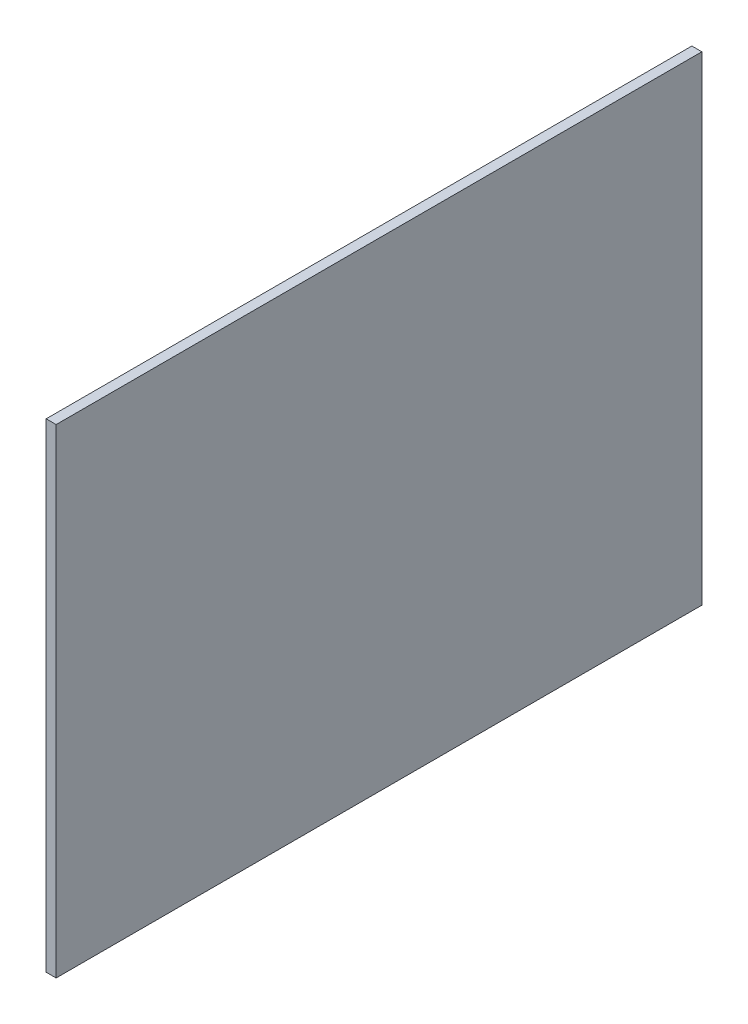
ISO-10303-21;
HEADER;
FILE_DESCRIPTION(('STEP AP214'),'2;1');
FILE_NAME('part.step','',(''),(''),'','','');
FILE_SCHEMA(('AUTOMOTIVE_DESIGN { 1 0 10303 214 1 1 1 1 }'));
ENDSEC;
DATA;
#1=APPLICATION_CONTEXT('core data for automotive mechanical design processes');
#2=APPLICATION_PROTOCOL_DEFINITION('international standard','automotive_design',2000,#1);
#3=PRODUCT_CONTEXT('',#1,'mechanical');
#4=PRODUCT('Part','Part','',(#3));
#5=PRODUCT_RELATED_PRODUCT_CATEGORY('part','',(#4));
#6=PRODUCT_DEFINITION_FORMATION('','',#4);
#7=PRODUCT_DEFINITION_CONTEXT('part definition',#1,'design');
#8=PRODUCT_DEFINITION('design','',#6,#7);
#9=PRODUCT_DEFINITION_SHAPE('','',#8);
#10=(LENGTH_UNIT() NAMED_UNIT(*) SI_UNIT(.MILLI.,.METRE.));
#11=(NAMED_UNIT(*) PLANE_ANGLE_UNIT() SI_UNIT($,.RADIAN.));
#12=(NAMED_UNIT(*) SI_UNIT($,.STERADIAN.) SOLID_ANGLE_UNIT());
#13=UNCERTAINTY_MEASURE_WITH_UNIT(LENGTH_MEASURE(1.E-05),#10,'distance_accuracy_value','');
#14=(GEOMETRIC_REPRESENTATION_CONTEXT(3) GLOBAL_UNCERTAINTY_ASSIGNED_CONTEXT((#13)) GLOBAL_UNIT_ASSIGNED_CONTEXT((#10,
#11,#12)) REPRESENTATION_CONTEXT('',''));
#15=CARTESIAN_POINT('',(0.,0.,0.));
#16=DIRECTION('',(0.,0.,1.));
#17=DIRECTION('',(1.,0.,0.));
#18=AXIS2_PLACEMENT_3D('',#15,#16,#17);
#19=CARTESIAN_POINT('',(3.,72.,97.));
#20=DIRECTION('',(0.,0.,-1.));
#21=DIRECTION('',(0.,1.,0.));
#22=AXIS2_PLACEMENT_3D('',#19,#20,#21);
#23=PLANE('',#22);
#24=DIRECTION('',(0.,-1.,0.));
#25=VECTOR('',#24,1.);
#26=CARTESIAN_POINT('',(0.,72.,97.));
#27=LINE('',#26,#25);
#28=CARTESIAN_POINT('',(0.,72.,97.));
#29=VERTEX_POINT('',#28);
#30=CARTESIAN_POINT('',(0.,-72.,97.));
#31=VERTEX_POINT('',#30);
#32=EDGE_CURVE('E98',#29,#31,#27,.T.);
#33=ORIENTED_EDGE('',*,*,#32,.T.);
#34=DIRECTION('',(-1.,0.,0.));
#35=VECTOR('',#34,1.);
#36=CARTESIAN_POINT('',(3.,-72.,97.));
#37=LINE('',#36,#35);
#38=CARTESIAN_POINT('',(3.,-72.,97.));
#39=VERTEX_POINT('',#38);
#40=EDGE_CURVE('E11',#39,#31,#37,.T.);
#41=ORIENTED_EDGE('',*,*,#40,.F.);
#42=DIRECTION('',(0.,-1.,0.));
#43=VECTOR('',#42,1.);
#44=CARTESIAN_POINT('',(3.,72.,97.));
#45=LINE('',#44,#43);
#46=CARTESIAN_POINT('',(3.,72.,97.));
#47=VERTEX_POINT('',#46);
#48=EDGE_CURVE('E86',#47,#39,#45,.T.);
#49=ORIENTED_EDGE('',*,*,#48,.F.);
#50=DIRECTION('',(-1.,0.,0.));
#51=VECTOR('',#50,1.);
#52=CARTESIAN_POINT('',(3.,72.,97.));
#53=LINE('',#52,#51);
#54=EDGE_CURVE('E94',#47,#29,#53,.T.);
#55=ORIENTED_EDGE('',*,*,#54,.T.);
#56=EDGE_LOOP('',(#33,#41,#49,#55));
#57=FACE_BOUND('',#56,.T.);
#58=ADVANCED_FACE('F35',(#57),#23,.F.);
#59=CARTESIAN_POINT('',(3.,-72.,97.));
#60=DIRECTION('',(0.,1.,0.));
#61=DIRECTION('',(0.,0.,1.));
#62=AXIS2_PLACEMENT_3D('',#59,#60,#61);
#63=PLANE('',#62);
#64=DIRECTION('',(0.,0.,-1.));
#65=VECTOR('',#64,1.);
#66=CARTESIAN_POINT('',(0.,-72.,97.));
#67=LINE('',#66,#65);
#68=CARTESIAN_POINT('',(0.,-72.,-97.));
#69=VERTEX_POINT('',#68);
#70=EDGE_CURVE('E90',#31,#69,#67,.T.);
#71=ORIENTED_EDGE('',*,*,#70,.T.);
#72=DIRECTION('',(-1.,0.,0.));
#73=VECTOR('',#72,1.);
#74=CARTESIAN_POINT('',(3.,-72.,-97.));
#75=LINE('',#74,#73);
#76=CARTESIAN_POINT('',(3.,-72.,-97.));
#77=VERTEX_POINT('',#76);
#78=EDGE_CURVE('E43',#77,#69,#75,.T.);
#79=ORIENTED_EDGE('',*,*,#78,.F.);
#80=DIRECTION('',(0.,0.,-1.));
#81=VECTOR('',#80,1.);
#82=CARTESIAN_POINT('',(3.,-72.,97.));
#83=LINE('',#82,#81);
#84=EDGE_CURVE('E81',#39,#77,#83,.T.);
#85=ORIENTED_EDGE('',*,*,#84,.F.);
#86=ORIENTED_EDGE('',*,*,#40,.T.);
#87=EDGE_LOOP('',(#71,#79,#85,#86));
#88=FACE_BOUND('',#87,.T.);
#89=ADVANCED_FACE('F89',(#88),#63,.F.);
#90=CARTESIAN_POINT('',(3.,72.,-97.));
#91=DIRECTION('',(0.,0.,1.));
#92=DIRECTION('',(0.,-1.,0.));
#93=AXIS2_PLACEMENT_3D('',#90,#91,#92);
#94=PLANE('',#93);
#95=DIRECTION('',(0.,1.,0.));
#96=VECTOR('',#95,1.);
#97=CARTESIAN_POINT('',(0.,72.,-97.));
#98=LINE('',#97,#96);
#99=CARTESIAN_POINT('',(0.,72.,-97.));
#100=VERTEX_POINT('',#99);
#101=EDGE_CURVE('E68',#69,#100,#98,.T.);
#102=ORIENTED_EDGE('',*,*,#101,.T.);
#103=DIRECTION('',(-1.,0.,0.));
#104=VECTOR('',#103,1.);
#105=CARTESIAN_POINT('',(3.,72.,-97.));
#106=LINE('',#105,#104);
#107=CARTESIAN_POINT('',(3.,72.,-97.));
#108=VERTEX_POINT('',#107);
#109=EDGE_CURVE('E91',#108,#100,#106,.T.);
#110=ORIENTED_EDGE('',*,*,#109,.F.);
#111=DIRECTION('',(0.,1.,0.));
#112=VECTOR('',#111,1.);
#113=CARTESIAN_POINT('',(3.,72.,-97.));
#114=LINE('',#113,#112);
#115=EDGE_CURVE('E84',#77,#108,#114,.T.);
#116=ORIENTED_EDGE('',*,*,#115,.F.);
#117=ORIENTED_EDGE('',*,*,#78,.T.);
#118=EDGE_LOOP('',(#102,#110,#116,#117));
#119=FACE_BOUND('',#118,.T.);
#120=ADVANCED_FACE('F92',(#119),#94,.F.);
#121=CARTESIAN_POINT('',(3.,72.,97.));
#122=DIRECTION('',(0.,-1.,0.));
#123=DIRECTION('',(0.,0.,-1.));
#124=AXIS2_PLACEMENT_3D('',#121,#122,#123);
#125=PLANE('',#124);
#126=DIRECTION('',(0.,0.,1.));
#127=VECTOR('',#126,1.);
#128=CARTESIAN_POINT('',(0.,72.,97.));
#129=LINE('',#128,#127);
#130=EDGE_CURVE('E74',#100,#29,#129,.T.);
#131=ORIENTED_EDGE('',*,*,#130,.T.);
#132=ORIENTED_EDGE('',*,*,#54,.F.);
#133=DIRECTION('',(0.,0.,1.));
#134=VECTOR('',#133,1.);
#135=CARTESIAN_POINT('',(3.,72.,97.));
#136=LINE('',#135,#134);
#137=EDGE_CURVE('E51',#108,#47,#136,.T.);
#138=ORIENTED_EDGE('',*,*,#137,.F.);
#139=ORIENTED_EDGE('',*,*,#109,.T.);
#140=EDGE_LOOP('',(#131,#132,#138,#139));
#141=FACE_BOUND('',#140,.T.);
#142=ADVANCED_FACE('F105',(#141),#125,.F.);
#143=CARTESIAN_POINT('',(3.,0.,0.));
#144=DIRECTION('',(1.,0.,0.));
#145=DIRECTION('',(0.,0.,-1.));
#146=AXIS2_PLACEMENT_3D('',#143,#144,#145);
#147=PLANE('',#146);
#148=ORIENTED_EDGE('',*,*,#48,.T.);
#149=ORIENTED_EDGE('',*,*,#84,.T.);
#150=ORIENTED_EDGE('',*,*,#115,.T.);
#151=ORIENTED_EDGE('',*,*,#137,.T.);
#152=EDGE_LOOP('',(#148,#149,#150,#151));
#153=FACE_BOUND('',#152,.T.);
#154=ADVANCED_FACE('F82',(#153),#147,.T.);
#155=CARTESIAN_POINT('',(0.,0.,0.));
#156=DIRECTION('',(1.,0.,0.));
#157=DIRECTION('',(0.,0.,-1.));
#158=AXIS2_PLACEMENT_3D('',#155,#156,#157);
#159=PLANE('',#158);
#160=ORIENTED_EDGE('',*,*,#32,.F.);
#161=ORIENTED_EDGE('',*,*,#130,.F.);
#162=ORIENTED_EDGE('',*,*,#101,.F.);
#163=ORIENTED_EDGE('',*,*,#70,.F.);
#164=EDGE_LOOP('',(#160,#161,#162,#163));
#165=FACE_BOUND('',#164,.T.);
#166=ADVANCED_FACE('F108',(#165),#159,.F.);
#167=CLOSED_SHELL('',(#58,#89,#120,#142,#154,#166));
#168=MANIFOLD_SOLID_BREP('B2',#167);
#169=ADVANCED_BREP_SHAPE_REPRESENTATION('',(#18,#168),#14);
#170=SHAPE_DEFINITION_REPRESENTATION(#9,#169);
ENDSEC;
END-ISO-10303-21;
